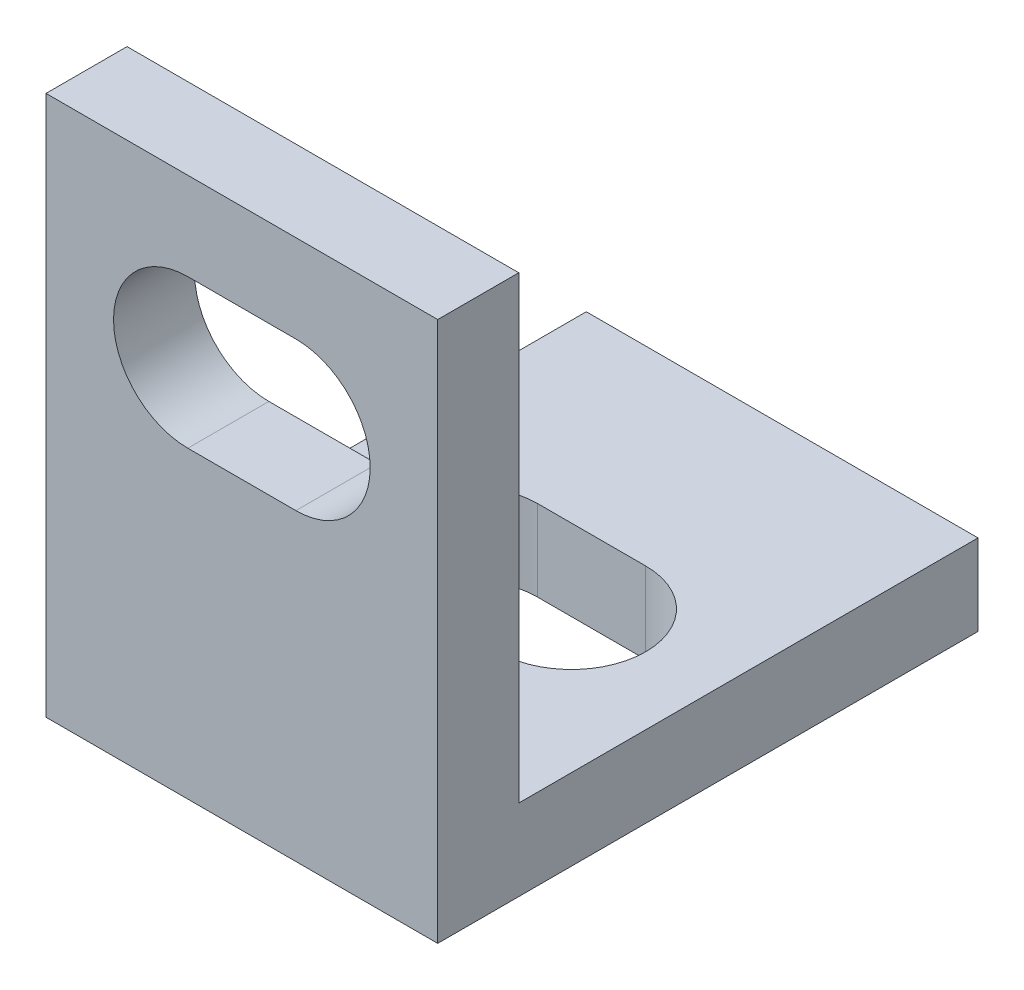
ISO-10303-21;
HEADER;
FILE_DESCRIPTION(('STEP AP214'),'2;1');
FILE_NAME('part.step','',(''),(''),'','','');
FILE_SCHEMA(('AUTOMOTIVE_DESIGN { 1 0 10303 214 1 1 1 1 }'));
ENDSEC;
DATA;
#1=APPLICATION_CONTEXT('core data for automotive mechanical design processes');
#2=APPLICATION_PROTOCOL_DEFINITION('international standard','automotive_design',2000,#1);
#3=PRODUCT_CONTEXT('',#1,'mechanical');
#4=PRODUCT('Part','Part','',(#3));
#5=PRODUCT_RELATED_PRODUCT_CATEGORY('part','',(#4));
#6=PRODUCT_DEFINITION_FORMATION('','',#4);
#7=PRODUCT_DEFINITION_CONTEXT('part definition',#1,'design');
#8=PRODUCT_DEFINITION('design','',#6,#7);
#9=PRODUCT_DEFINITION_SHAPE('','',#8);
#10=(LENGTH_UNIT() NAMED_UNIT(*) SI_UNIT(.MILLI.,.METRE.));
#11=(NAMED_UNIT(*) PLANE_ANGLE_UNIT() SI_UNIT($,.RADIAN.));
#12=(NAMED_UNIT(*) SI_UNIT($,.STERADIAN.) SOLID_ANGLE_UNIT());
#13=UNCERTAINTY_MEASURE_WITH_UNIT(LENGTH_MEASURE(1.E-05),#10,'distance_accuracy_value','');
#14=(GEOMETRIC_REPRESENTATION_CONTEXT(3) GLOBAL_UNCERTAINTY_ASSIGNED_CONTEXT((#13)) GLOBAL_UNIT_ASSIGNED_CONTEXT((#10,
#11,#12)) REPRESENTATION_CONTEXT('',''));
#15=CARTESIAN_POINT('',(0.,0.,0.));
#16=DIRECTION('',(0.,0.,1.));
#17=DIRECTION('',(1.,0.,0.));
#18=AXIS2_PLACEMENT_3D('',#15,#16,#17);
#19=CARTESIAN_POINT('',(14.5,0.,-20.));
#20=DIRECTION('',(0.,1.,0.));
#21=DIRECTION('',(0.,0.,1.));
#22=AXIS2_PLACEMENT_3D('',#19,#20,#21);
#23=PLANE('',#22);
#24=DIRECTION('',(1.,0.,0.));
#25=VECTOR('',#24,1.);
#26=CARTESIAN_POINT('',(5.25,0.,-12.95));
#27=LINE('',#26,#25);
#28=CARTESIAN_POINT('',(5.25,0.,-12.95));
#29=VERTEX_POINT('',#28);
#30=CARTESIAN_POINT('',(9.25,0.,-12.95));
#31=VERTEX_POINT('',#30);
#32=EDGE_CURVE('E145',#29,#31,#27,.T.);
#33=ORIENTED_EDGE('',*,*,#32,.F.);
#34=CARTESIAN_POINT('',(5.25,0.,-10.2));
#35=DIRECTION('',(0.,-1.,0.));
#36=DIRECTION('',(0.,0.,-1.));
#37=AXIS2_PLACEMENT_3D('',#34,#35,#36);
#38=CIRCLE('',#37,2.75);
#39=CARTESIAN_POINT('',(5.25,0.,-7.45));
#40=VERTEX_POINT('',#39);
#41=EDGE_CURVE('E47',#40,#29,#38,.T.);
#42=ORIENTED_EDGE('',*,*,#41,.F.);
#43=DIRECTION('',(-1.,0.,0.));
#44=VECTOR('',#43,1.);
#45=CARTESIAN_POINT('',(5.25,0.,-7.45));
#46=LINE('',#45,#44);
#47=CARTESIAN_POINT('',(9.25,0.,-7.45));
#48=VERTEX_POINT('',#47);
#49=EDGE_CURVE('E151',#48,#40,#46,.T.);
#50=ORIENTED_EDGE('',*,*,#49,.F.);
#51=CARTESIAN_POINT('',(9.25,0.,-10.2));
#52=DIRECTION('',(0.,-1.,0.));
#53=DIRECTION('',(0.,0.,-1.));
#54=AXIS2_PLACEMENT_3D('',#51,#52,#53);
#55=CIRCLE('',#54,2.75);
#56=EDGE_CURVE('E136',#31,#48,#55,.T.);
#57=ORIENTED_EDGE('',*,*,#56,.F.);
#58=EDGE_LOOP('',(#33,#42,#50,#57));
#59=FACE_BOUND('',#58,.T.);
#60=DIRECTION('',(0.,0.,-1.));
#61=VECTOR('',#60,1.);
#62=CARTESIAN_POINT('',(0.,0.,-20.));
#63=LINE('',#62,#61);
#64=CARTESIAN_POINT('',(0.,0.,0.));
#65=VERTEX_POINT('',#64);
#66=CARTESIAN_POINT('',(0.,0.,-20.));
#67=VERTEX_POINT('',#66);
#68=EDGE_CURVE('E192',#65,#67,#63,.T.);
#69=ORIENTED_EDGE('',*,*,#68,.T.);
#70=DIRECTION('',(-1.,0.,0.));
#71=VECTOR('',#70,1.);
#72=CARTESIAN_POINT('',(14.5,0.,-20.));
#73=LINE('',#72,#71);
#74=CARTESIAN_POINT('',(14.5,0.,-20.));
#75=VERTEX_POINT('',#74);
#76=EDGE_CURVE('E233',#75,#67,#73,.T.);
#77=ORIENTED_EDGE('',*,*,#76,.F.);
#78=DIRECTION('',(0.,0.,-1.));
#79=VECTOR('',#78,1.);
#80=CARTESIAN_POINT('',(14.5,0.,-20.));
#81=LINE('',#80,#79);
#82=CARTESIAN_POINT('',(14.5,0.,0.));
#83=VERTEX_POINT('',#82);
#84=EDGE_CURVE('E193',#83,#75,#81,.T.);
#85=ORIENTED_EDGE('',*,*,#84,.F.);
#86=DIRECTION('',(-1.,0.,0.));
#87=VECTOR('',#86,1.);
#88=CARTESIAN_POINT('',(14.5,0.,0.));
#89=LINE('',#88,#87);
#90=EDGE_CURVE('E207',#83,#65,#89,.T.);
#91=ORIENTED_EDGE('',*,*,#90,.T.);
#92=EDGE_LOOP('',(#69,#77,#85,#91));
#93=FACE_BOUND('',#92,.T.);
#94=ADVANCED_FACE('F33',(#59,#93),#23,.F.);
#95=CARTESIAN_POINT('',(14.5,3.,-20.));
#96=DIRECTION('',(0.,0.,1.));
#97=DIRECTION('',(1.,0.,0.));
#98=AXIS2_PLACEMENT_3D('',#95,#96,#97);
#99=PLANE('',#98);
#100=DIRECTION('',(0.,1.,0.));
#101=VECTOR('',#100,1.);
#102=CARTESIAN_POINT('',(0.,3.,-20.));
#103=LINE('',#102,#101);
#104=CARTESIAN_POINT('',(0.,3.,-20.));
#105=VERTEX_POINT('',#104);
#106=EDGE_CURVE('E210',#67,#105,#103,.T.);
#107=ORIENTED_EDGE('',*,*,#106,.T.);
#108=DIRECTION('',(-1.,0.,0.));
#109=VECTOR('',#108,1.);
#110=CARTESIAN_POINT('',(14.5,3.,-20.));
#111=LINE('',#110,#109);
#112=CARTESIAN_POINT('',(14.5,3.,-20.));
#113=VERTEX_POINT('',#112);
#114=EDGE_CURVE('E230',#113,#105,#111,.T.);
#115=ORIENTED_EDGE('',*,*,#114,.F.);
#116=DIRECTION('',(0.,1.,0.));
#117=VECTOR('',#116,1.);
#118=CARTESIAN_POINT('',(14.5,3.,-20.));
#119=LINE('',#118,#117);
#120=EDGE_CURVE('E196',#75,#113,#119,.T.);
#121=ORIENTED_EDGE('',*,*,#120,.F.);
#122=ORIENTED_EDGE('',*,*,#76,.T.);
#123=EDGE_LOOP('',(#107,#115,#121,#122));
#124=FACE_BOUND('',#123,.T.);
#125=ADVANCED_FACE('F260',(#124),#99,.F.);
#126=CARTESIAN_POINT('',(14.5,3.,-3.));
#127=DIRECTION('',(0.,-1.,0.));
#128=DIRECTION('',(0.,0.,-1.));
#129=AXIS2_PLACEMENT_3D('',#126,#127,#128);
#130=PLANE('',#129);
#131=DIRECTION('',(-1.,0.,0.));
#132=VECTOR('',#131,1.);
#133=CARTESIAN_POINT('',(14.5,3.,-7.45));
#134=LINE('',#133,#132);
#135=CARTESIAN_POINT('',(9.25,3.,-7.45));
#136=VERTEX_POINT('',#135);
#137=CARTESIAN_POINT('',(5.25,3.,-7.45));
#138=VERTEX_POINT('',#137);
#139=EDGE_CURVE('E40',#136,#138,#134,.T.);
#140=ORIENTED_EDGE('',*,*,#139,.T.);
#141=CARTESIAN_POINT('',(5.25,3.,-10.2));
#142=DIRECTION('',(0.,-1.,0.));
#143=DIRECTION('',(0.,0.,-1.));
#144=AXIS2_PLACEMENT_3D('',#141,#142,#143);
#145=CIRCLE('',#144,2.75);
#146=CARTESIAN_POINT('',(5.25,3.,-12.95));
#147=VERTEX_POINT('',#146);
#148=EDGE_CURVE('E11',#138,#147,#145,.T.);
#149=ORIENTED_EDGE('',*,*,#148,.T.);
#150=DIRECTION('',(1.,0.,0.));
#151=VECTOR('',#150,1.);
#152=CARTESIAN_POINT('',(14.5,3.,-12.95));
#153=LINE('',#152,#151);
#154=CARTESIAN_POINT('',(9.25,3.,-12.95));
#155=VERTEX_POINT('',#154);
#156=EDGE_CURVE('E236',#147,#155,#153,.T.);
#157=ORIENTED_EDGE('',*,*,#156,.T.);
#158=CARTESIAN_POINT('',(9.25,3.,-10.2));
#159=DIRECTION('',(0.,-1.,0.));
#160=DIRECTION('',(0.,0.,-1.));
#161=AXIS2_PLACEMENT_3D('',#158,#159,#160);
#162=CIRCLE('',#161,2.75);
#163=EDGE_CURVE('E139',#155,#136,#162,.T.);
#164=ORIENTED_EDGE('',*,*,#163,.T.);
#165=EDGE_LOOP('',(#140,#149,#157,#164));
#166=FACE_BOUND('',#165,.T.);
#167=DIRECTION('',(0.,0.,1.));
#168=VECTOR('',#167,1.);
#169=CARTESIAN_POINT('',(0.,3.,-3.));
#170=LINE('',#169,#168);
#171=CARTESIAN_POINT('',(0.,3.,-3.));
#172=VERTEX_POINT('',#171);
#173=EDGE_CURVE('E212',#105,#172,#170,.T.);
#174=ORIENTED_EDGE('',*,*,#173,.T.);
#175=DIRECTION('',(-1.,0.,0.));
#176=VECTOR('',#175,1.);
#177=CARTESIAN_POINT('',(14.5,3.,-3.));
#178=LINE('',#177,#176);
#179=CARTESIAN_POINT('',(14.5,3.,-3.));
#180=VERTEX_POINT('',#179);
#181=EDGE_CURVE('E227',#180,#172,#178,.T.);
#182=ORIENTED_EDGE('',*,*,#181,.F.);
#183=DIRECTION('',(0.,0.,1.));
#184=VECTOR('',#183,1.);
#185=CARTESIAN_POINT('',(14.5,3.,-3.));
#186=LINE('',#185,#184);
#187=EDGE_CURVE('E199',#113,#180,#186,.T.);
#188=ORIENTED_EDGE('',*,*,#187,.F.);
#189=ORIENTED_EDGE('',*,*,#114,.T.);
#190=EDGE_LOOP('',(#174,#182,#188,#189));
#191=FACE_BOUND('',#190,.T.);
#192=ADVANCED_FACE('F240',(#166,#191),#130,.F.);
#193=CARTESIAN_POINT('',(14.5,20.,-3.));
#194=DIRECTION('',(0.,0.,1.));
#195=DIRECTION('',(0.,-1.,0.));
#196=AXIS2_PLACEMENT_3D('',#193,#194,#195);
#197=PLANE('',#196);
#198=CARTESIAN_POINT('',(5.25,14.,-3.));
#199=DIRECTION('',(0.,0.,1.));
#200=DIRECTION('',(0.,-1.,0.));
#201=AXIS2_PLACEMENT_3D('',#198,#199,#200);
#202=CIRCLE('',#201,2.75);
#203=CARTESIAN_POINT('',(5.25,16.75,-3.));
#204=VERTEX_POINT('',#203);
#205=CARTESIAN_POINT('',(5.25,11.25,-3.));
#206=VERTEX_POINT('',#205);
#207=EDGE_CURVE('E186',#204,#206,#202,.T.);
#208=ORIENTED_EDGE('',*,*,#207,.T.);
#209=DIRECTION('',(1.,0.,0.));
#210=VECTOR('',#209,1.);
#211=CARTESIAN_POINT('',(14.5,11.25,-3.));
#212=LINE('',#211,#210);
#213=CARTESIAN_POINT('',(9.25,11.25,-3.));
#214=VERTEX_POINT('',#213);
#215=EDGE_CURVE('E189',#206,#214,#212,.T.);
#216=ORIENTED_EDGE('',*,*,#215,.T.);
#217=CARTESIAN_POINT('',(9.25,14.,-3.));
#218=DIRECTION('',(0.,0.,1.));
#219=DIRECTION('',(0.,-1.,0.));
#220=AXIS2_PLACEMENT_3D('',#217,#218,#219);
#221=CIRCLE('',#220,2.75);
#222=CARTESIAN_POINT('',(9.25,16.75,-3.));
#223=VERTEX_POINT('',#222);
#224=EDGE_CURVE('E174',#214,#223,#221,.T.);
#225=ORIENTED_EDGE('',*,*,#224,.T.);
#226=DIRECTION('',(1.,0.,0.));
#227=VECTOR('',#226,1.);
#228=CARTESIAN_POINT('',(14.5,16.75,-3.));
#229=LINE('',#228,#227);
#230=EDGE_CURVE('E183',#204,#223,#229,.T.);
#231=ORIENTED_EDGE('',*,*,#230,.F.);
#232=EDGE_LOOP('',(#208,#216,#225,#231));
#233=FACE_BOUND('',#232,.T.);
#234=DIRECTION('',(0.,1.,0.));
#235=VECTOR('',#234,1.);
#236=CARTESIAN_POINT('',(0.,20.,-3.));
#237=LINE('',#236,#235);
#238=CARTESIAN_POINT('',(0.,20.,-3.));
#239=VERTEX_POINT('',#238);
#240=EDGE_CURVE('E214',#172,#239,#237,.T.);
#241=ORIENTED_EDGE('',*,*,#240,.T.);
#242=DIRECTION('',(-1.,0.,0.));
#243=VECTOR('',#242,1.);
#244=CARTESIAN_POINT('',(14.5,20.,-3.));
#245=LINE('',#244,#243);
#246=CARTESIAN_POINT('',(14.5,20.,-3.));
#247=VERTEX_POINT('',#246);
#248=EDGE_CURVE('E224',#247,#239,#245,.T.);
#249=ORIENTED_EDGE('',*,*,#248,.F.);
#250=DIRECTION('',(0.,1.,0.));
#251=VECTOR('',#250,1.);
#252=CARTESIAN_POINT('',(14.5,20.,-3.));
#253=LINE('',#252,#251);
#254=EDGE_CURVE('E201',#180,#247,#253,.T.);
#255=ORIENTED_EDGE('',*,*,#254,.F.);
#256=ORIENTED_EDGE('',*,*,#181,.T.);
#257=EDGE_LOOP('',(#241,#249,#255,#256));
#258=FACE_BOUND('',#257,.T.);
#259=ADVANCED_FACE('F270',(#233,#258),#197,.F.);
#260=CARTESIAN_POINT('',(14.5,20.,0.));
#261=DIRECTION('',(0.,-1.,0.));
#262=DIRECTION('',(0.,0.,-1.));
#263=AXIS2_PLACEMENT_3D('',#260,#261,#262);
#264=PLANE('',#263);
#265=DIRECTION('',(0.,0.,1.));
#266=VECTOR('',#265,1.);
#267=CARTESIAN_POINT('',(0.,20.,0.));
#268=LINE('',#267,#266);
#269=CARTESIAN_POINT('',(0.,20.,0.));
#270=VERTEX_POINT('',#269);
#271=EDGE_CURVE('E216',#239,#270,#268,.T.);
#272=ORIENTED_EDGE('',*,*,#271,.T.);
#273=DIRECTION('',(-1.,0.,0.));
#274=VECTOR('',#273,1.);
#275=CARTESIAN_POINT('',(14.5,20.,0.));
#276=LINE('',#275,#274);
#277=CARTESIAN_POINT('',(14.5,20.,0.));
#278=VERTEX_POINT('',#277);
#279=EDGE_CURVE('E221',#278,#270,#276,.T.);
#280=ORIENTED_EDGE('',*,*,#279,.F.);
#281=DIRECTION('',(0.,0.,1.));
#282=VECTOR('',#281,1.);
#283=CARTESIAN_POINT('',(14.5,20.,0.));
#284=LINE('',#283,#282);
#285=EDGE_CURVE('E203',#247,#278,#284,.T.);
#286=ORIENTED_EDGE('',*,*,#285,.F.);
#287=ORIENTED_EDGE('',*,*,#248,.T.);
#288=EDGE_LOOP('',(#272,#280,#286,#287));
#289=FACE_BOUND('',#288,.T.);
#290=ADVANCED_FACE('F275',(#289),#264,.F.);
#291=CARTESIAN_POINT('',(14.5,0.,0.));
#292=DIRECTION('',(0.,0.,-1.));
#293=DIRECTION('',(-1.,0.,0.));
#294=AXIS2_PLACEMENT_3D('',#291,#292,#293);
#295=PLANE('',#294);
#296=CARTESIAN_POINT('',(9.25,14.,0.));
#297=DIRECTION('',(0.,0.,1.));
#298=DIRECTION('',(1.,0.,0.));
#299=AXIS2_PLACEMENT_3D('',#296,#297,#298);
#300=CIRCLE('',#299,2.75);
#301=CARTESIAN_POINT('',(9.25,11.25,0.));
#302=VERTEX_POINT('',#301);
#303=CARTESIAN_POINT('',(9.25,16.75,0.));
#304=VERTEX_POINT('',#303);
#305=EDGE_CURVE('E162',#302,#304,#300,.T.);
#306=ORIENTED_EDGE('',*,*,#305,.F.);
#307=DIRECTION('',(1.,0.,0.));
#308=VECTOR('',#307,1.);
#309=CARTESIAN_POINT('',(5.25,11.25,0.));
#310=LINE('',#309,#308);
#311=CARTESIAN_POINT('',(5.25,11.25,0.));
#312=VERTEX_POINT('',#311);
#313=EDGE_CURVE('E158',#312,#302,#310,.T.);
#314=ORIENTED_EDGE('',*,*,#313,.F.);
#315=CARTESIAN_POINT('',(5.25,14.,0.));
#316=DIRECTION('',(0.,0.,1.));
#317=DIRECTION('',(1.,0.,0.));
#318=AXIS2_PLACEMENT_3D('',#315,#316,#317);
#319=CIRCLE('',#318,2.75);
#320=CARTESIAN_POINT('',(5.25,16.75,0.));
#321=VERTEX_POINT('',#320);
#322=EDGE_CURVE('E168',#321,#312,#319,.T.);
#323=ORIENTED_EDGE('',*,*,#322,.F.);
#324=DIRECTION('',(1.,0.,0.));
#325=VECTOR('',#324,1.);
#326=CARTESIAN_POINT('',(5.25,16.75,0.));
#327=LINE('',#326,#325);
#328=EDGE_CURVE('E165',#321,#304,#327,.T.);
#329=ORIENTED_EDGE('',*,*,#328,.T.);
#330=EDGE_LOOP('',(#306,#314,#323,#329));
#331=FACE_BOUND('',#330,.T.);
#332=DIRECTION('',(0.,-1.,0.));
#333=VECTOR('',#332,1.);
#334=CARTESIAN_POINT('',(0.,0.,0.));
#335=LINE('',#334,#333);
#336=EDGE_CURVE('E197',#270,#65,#335,.T.);
#337=ORIENTED_EDGE('',*,*,#336,.T.);
#338=ORIENTED_EDGE('',*,*,#90,.F.);
#339=DIRECTION('',(0.,-1.,0.));
#340=VECTOR('',#339,1.);
#341=CARTESIAN_POINT('',(14.5,0.,0.));
#342=LINE('',#341,#340);
#343=EDGE_CURVE('E205',#278,#83,#342,.T.);
#344=ORIENTED_EDGE('',*,*,#343,.F.);
#345=ORIENTED_EDGE('',*,*,#279,.T.);
#346=EDGE_LOOP('',(#337,#338,#344,#345));
#347=FACE_BOUND('',#346,.T.);
#348=ADVANCED_FACE('F279',(#331,#347),#295,.F.);
#349=CARTESIAN_POINT('',(14.5,0.,0.));
#350=DIRECTION('',(-1.,0.,0.));
#351=DIRECTION('',(0.,0.,1.));
#352=AXIS2_PLACEMENT_3D('',#349,#350,#351);
#353=PLANE('',#352);
#354=ORIENTED_EDGE('',*,*,#84,.T.);
#355=ORIENTED_EDGE('',*,*,#120,.T.);
#356=ORIENTED_EDGE('',*,*,#187,.T.);
#357=ORIENTED_EDGE('',*,*,#254,.T.);
#358=ORIENTED_EDGE('',*,*,#285,.T.);
#359=ORIENTED_EDGE('',*,*,#343,.T.);
#360=EDGE_LOOP('',(#354,#355,#356,#357,#358,#359));
#361=FACE_BOUND('',#360,.T.);
#362=ADVANCED_FACE('F283',(#361),#353,.F.);
#363=CARTESIAN_POINT('',(0.,0.,0.));
#364=DIRECTION('',(-1.,0.,0.));
#365=DIRECTION('',(0.,0.,1.));
#366=AXIS2_PLACEMENT_3D('',#363,#364,#365);
#367=PLANE('',#366);
#368=ORIENTED_EDGE('',*,*,#68,.F.);
#369=ORIENTED_EDGE('',*,*,#336,.F.);
#370=ORIENTED_EDGE('',*,*,#271,.F.);
#371=ORIENTED_EDGE('',*,*,#240,.F.);
#372=ORIENTED_EDGE('',*,*,#173,.F.);
#373=ORIENTED_EDGE('',*,*,#106,.F.);
#374=EDGE_LOOP('',(#368,#369,#370,#371,#372,#373));
#375=FACE_BOUND('',#374,.T.);
#376=ADVANCED_FACE('F285',(#375),#367,.T.);
#377=CARTESIAN_POINT('',(5.25,11.25,-20.));
#378=DIRECTION('',(0.,-1.,0.));
#379=DIRECTION('',(0.,0.,-1.));
#380=AXIS2_PLACEMENT_3D('',#377,#378,#379);
#381=PLANE('',#380);
#382=DIRECTION('',(0.,0.,1.));
#383=VECTOR('',#382,1.);
#384=CARTESIAN_POINT('',(5.25,11.25,-20.));
#385=LINE('',#384,#383);
#386=EDGE_CURVE('E172',#206,#312,#385,.T.);
#387=ORIENTED_EDGE('',*,*,#386,.T.);
#388=ORIENTED_EDGE('',*,*,#313,.T.);
#389=DIRECTION('',(0.,0.,1.));
#390=VECTOR('',#389,1.);
#391=CARTESIAN_POINT('',(9.25,11.25,-20.));
#392=LINE('',#391,#390);
#393=EDGE_CURVE('E171',#214,#302,#392,.T.);
#394=ORIENTED_EDGE('',*,*,#393,.F.);
#395=ORIENTED_EDGE('',*,*,#215,.F.);
#396=EDGE_LOOP('',(#387,#388,#394,#395));
#397=FACE_BOUND('',#396,.T.);
#398=ADVANCED_FACE('F288',(#397),#381,.F.);
#399=CARTESIAN_POINT('',(5.25,14.,-20.));
#400=DIRECTION('',(0.,0.,1.));
#401=DIRECTION('',(1.,0.,0.));
#402=AXIS2_PLACEMENT_3D('',#399,#400,#401);
#403=CYLINDRICAL_SURFACE('',#402,2.75);
#404=DIRECTION('',(0.,0.,1.));
#405=VECTOR('',#404,1.);
#406=CARTESIAN_POINT('',(5.25,16.75,-20.));
#407=LINE('',#406,#405);
#408=EDGE_CURVE('E175',#204,#321,#407,.T.);
#409=ORIENTED_EDGE('',*,*,#408,.T.);
#410=ORIENTED_EDGE('',*,*,#322,.T.);
#411=ORIENTED_EDGE('',*,*,#386,.F.);
#412=ORIENTED_EDGE('',*,*,#207,.F.);
#413=EDGE_LOOP('',(#409,#410,#411,#412));
#414=FACE_BOUND('',#413,.T.);
#415=ADVANCED_FACE('F294',(#414),#403,.F.);
#416=CARTESIAN_POINT('',(5.25,16.75,-20.));
#417=DIRECTION('',(0.,-1.,0.));
#418=DIRECTION('',(0.,0.,-1.));
#419=AXIS2_PLACEMENT_3D('',#416,#417,#418);
#420=PLANE('',#419);
#421=ORIENTED_EDGE('',*,*,#230,.T.);
#422=DIRECTION('',(0.,0.,1.));
#423=VECTOR('',#422,1.);
#424=CARTESIAN_POINT('',(9.25,16.75,-20.));
#425=LINE('',#424,#423);
#426=EDGE_CURVE('E177',#223,#304,#425,.T.);
#427=ORIENTED_EDGE('',*,*,#426,.T.);
#428=ORIENTED_EDGE('',*,*,#328,.F.);
#429=ORIENTED_EDGE('',*,*,#408,.F.);
#430=EDGE_LOOP('',(#421,#427,#428,#429));
#431=FACE_BOUND('',#430,.T.);
#432=ADVANCED_FACE('F254',(#431),#420,.T.);
#433=CARTESIAN_POINT('',(9.25,14.,-20.));
#434=DIRECTION('',(0.,0.,1.));
#435=DIRECTION('',(1.,0.,0.));
#436=AXIS2_PLACEMENT_3D('',#433,#434,#435);
#437=CYLINDRICAL_SURFACE('',#436,2.75);
#438=ORIENTED_EDGE('',*,*,#393,.T.);
#439=ORIENTED_EDGE('',*,*,#305,.T.);
#440=ORIENTED_EDGE('',*,*,#426,.F.);
#441=ORIENTED_EDGE('',*,*,#224,.F.);
#442=EDGE_LOOP('',(#438,#439,#440,#441));
#443=FACE_BOUND('',#442,.T.);
#444=ADVANCED_FACE('F247',(#443),#437,.F.);
#445=CARTESIAN_POINT('',(5.25,20.,-10.2));
#446=DIRECTION('',(0.,-1.,0.));
#447=DIRECTION('',(0.,0.,-1.));
#448=AXIS2_PLACEMENT_3D('',#445,#446,#447);
#449=CYLINDRICAL_SURFACE('',#448,2.75);
#450=DIRECTION('',(0.,-1.,0.));
#451=VECTOR('',#450,1.);
#452=CARTESIAN_POINT('',(5.25,20.,-7.45));
#453=LINE('',#452,#451);
#454=EDGE_CURVE('E156',#138,#40,#453,.T.);
#455=ORIENTED_EDGE('',*,*,#454,.T.);
#456=ORIENTED_EDGE('',*,*,#41,.T.);
#457=DIRECTION('',(0.,-1.,0.));
#458=VECTOR('',#457,1.);
#459=CARTESIAN_POINT('',(5.25,20.,-12.95));
#460=LINE('',#459,#458);
#461=EDGE_CURVE('E142',#147,#29,#460,.T.);
#462=ORIENTED_EDGE('',*,*,#461,.F.);
#463=ORIENTED_EDGE('',*,*,#148,.F.);
#464=EDGE_LOOP('',(#455,#456,#462,#463));
#465=FACE_BOUND('',#464,.T.);
#466=ADVANCED_FACE('F245',(#465),#449,.F.);
#467=CARTESIAN_POINT('',(5.25,20.,-7.45));
#468=DIRECTION('',(0.,0.,1.));
#469=DIRECTION('',(1.,0.,0.));
#470=AXIS2_PLACEMENT_3D('',#467,#468,#469);
#471=PLANE('',#470);
#472=DIRECTION('',(0.,-1.,0.));
#473=VECTOR('',#472,1.);
#474=CARTESIAN_POINT('',(9.25,20.,-7.45));
#475=LINE('',#474,#473);
#476=EDGE_CURVE('E141',#136,#48,#475,.T.);
#477=ORIENTED_EDGE('',*,*,#476,.T.);
#478=ORIENTED_EDGE('',*,*,#49,.T.);
#479=ORIENTED_EDGE('',*,*,#454,.F.);
#480=ORIENTED_EDGE('',*,*,#139,.F.);
#481=EDGE_LOOP('',(#477,#478,#479,#480));
#482=FACE_BOUND('',#481,.T.);
#483=ADVANCED_FACE('F244',(#482),#471,.F.);
#484=CARTESIAN_POINT('',(9.25,20.,-10.2));
#485=DIRECTION('',(0.,-1.,0.));
#486=DIRECTION('',(0.,0.,-1.));
#487=AXIS2_PLACEMENT_3D('',#484,#485,#486);
#488=CYLINDRICAL_SURFACE('',#487,2.75);
#489=DIRECTION('',(0.,-1.,0.));
#490=VECTOR('',#489,1.);
#491=CARTESIAN_POINT('',(9.25,20.,-12.95));
#492=LINE('',#491,#490);
#493=EDGE_CURVE('E55',#155,#31,#492,.T.);
#494=ORIENTED_EDGE('',*,*,#493,.T.);
#495=ORIENTED_EDGE('',*,*,#56,.T.);
#496=ORIENTED_EDGE('',*,*,#476,.F.);
#497=ORIENTED_EDGE('',*,*,#163,.F.);
#498=EDGE_LOOP('',(#494,#495,#496,#497));
#499=FACE_BOUND('',#498,.T.);
#500=ADVANCED_FACE('F133',(#499),#488,.F.);
#501=CARTESIAN_POINT('',(5.25,20.,-12.95));
#502=DIRECTION('',(0.,0.,-1.));
#503=DIRECTION('',(0.,1.,0.));
#504=AXIS2_PLACEMENT_3D('',#501,#502,#503);
#505=PLANE('',#504);
#506=ORIENTED_EDGE('',*,*,#461,.T.);
#507=ORIENTED_EDGE('',*,*,#32,.T.);
#508=ORIENTED_EDGE('',*,*,#493,.F.);
#509=ORIENTED_EDGE('',*,*,#156,.F.);
#510=EDGE_LOOP('',(#506,#507,#508,#509));
#511=FACE_BOUND('',#510,.T.);
#512=ADVANCED_FACE('F146',(#511),#505,.F.);
#513=CLOSED_SHELL('',(#94,#125,#192,#259,#290,#348,#362,#376,#398,#415,#432,#444,#466,#483,#500,#512));
#514=MANIFOLD_SOLID_BREP('B2',#513);
#515=ADVANCED_BREP_SHAPE_REPRESENTATION('',(#18,#514),#14);
#516=SHAPE_DEFINITION_REPRESENTATION(#9,#515);
ENDSEC;
END-ISO-10303-21;
